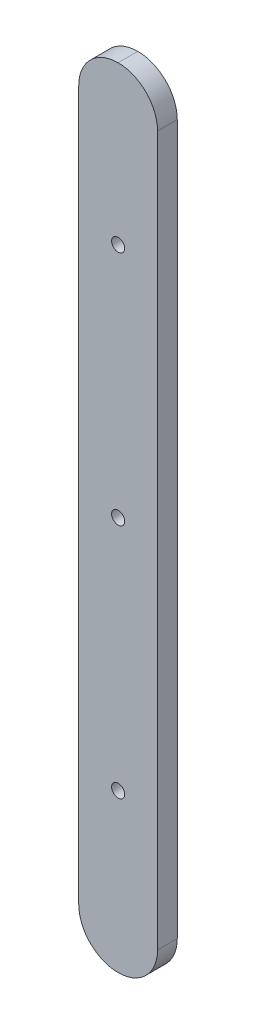
ISO-10303-21;
HEADER;
FILE_DESCRIPTION(('STEP AP214'),'2;1');
FILE_NAME('part.step','',(''),(''),'','','');
FILE_SCHEMA(('AUTOMOTIVE_DESIGN { 1 0 10303 214 1 1 1 1 }'));
ENDSEC;
DATA;
#1=APPLICATION_CONTEXT('core data for automotive mechanical design processes');
#2=APPLICATION_PROTOCOL_DEFINITION('international standard','automotive_design',2000,#1);
#3=PRODUCT_CONTEXT('',#1,'mechanical');
#4=PRODUCT('Part','Part','',(#3));
#5=PRODUCT_RELATED_PRODUCT_CATEGORY('part','',(#4));
#6=PRODUCT_DEFINITION_FORMATION('','',#4);
#7=PRODUCT_DEFINITION_CONTEXT('part definition',#1,'design');
#8=PRODUCT_DEFINITION('design','',#6,#7);
#9=PRODUCT_DEFINITION_SHAPE('','',#8);
#10=(LENGTH_UNIT() NAMED_UNIT(*) SI_UNIT(.MILLI.,.METRE.));
#11=(NAMED_UNIT(*) PLANE_ANGLE_UNIT() SI_UNIT($,.RADIAN.));
#12=(NAMED_UNIT(*) SI_UNIT($,.STERADIAN.) SOLID_ANGLE_UNIT());
#13=UNCERTAINTY_MEASURE_WITH_UNIT(LENGTH_MEASURE(1.E-05),#10,'distance_accuracy_value','');
#14=(GEOMETRIC_REPRESENTATION_CONTEXT(3) GLOBAL_UNCERTAINTY_ASSIGNED_CONTEXT((#13)) GLOBAL_UNIT_ASSIGNED_CONTEXT((#10,
#11,#12)) REPRESENTATION_CONTEXT('',''));
#15=CARTESIAN_POINT('',(0.,0.,0.));
#16=DIRECTION('',(0.,0.,1.));
#17=DIRECTION('',(1.,0.,0.));
#18=AXIS2_PLACEMENT_3D('',#15,#16,#17);
#19=CARTESIAN_POINT('',(0.,200.,5.));
#20=DIRECTION('',(0.,0.,-1.));
#21=DIRECTION('',(-1.,0.,0.));
#22=AXIS2_PLACEMENT_3D('',#19,#20,#21);
#23=PLANE('',#22);
#24=CARTESIAN_POINT('',(10.0000000000006,100.,5.));
#25=DIRECTION('',(0.,0.,1.));
#26=DIRECTION('',(1.,0.,0.));
#27=AXIS2_PLACEMENT_3D('',#24,#25,#26);
#28=CIRCLE('',#27,1.65000000000001);
#29=CARTESIAN_POINT('',(11.6500000000006,100.,5.));
#30=VERTEX_POINT('',#29);
#31=EDGE_CURVE('E147',#30,#30,#28,.T.);
#32=ORIENTED_EDGE('',*,*,#31,.F.);
#33=EDGE_LOOP('',(#32));
#34=FACE_BOUND('',#33,.T.);
#35=DIRECTION('',(0.,-1.,0.));
#36=VECTOR('',#35,1.);
#37=CARTESIAN_POINT('',(0.,0.,5.));
#38=LINE('',#37,#36);
#39=CARTESIAN_POINT('',(0.,190.,5.));
#40=VERTEX_POINT('',#39);
#41=CARTESIAN_POINT('',(0.,10.,5.));
#42=VERTEX_POINT('',#41);
#43=EDGE_CURVE('E92',#40,#42,#38,.T.);
#44=ORIENTED_EDGE('',*,*,#43,.T.);
#45=CARTESIAN_POINT('',(10.,10.,5.));
#46=DIRECTION('',(0.,0.,-1.));
#47=DIRECTION('',(-1.,0.,0.));
#48=AXIS2_PLACEMENT_3D('',#45,#46,#47);
#49=CIRCLE('',#48,10.);
#50=CARTESIAN_POINT('',(10.,0.,5.));
#51=VERTEX_POINT('',#50);
#52=EDGE_CURVE('E124',#42,#51,#49,.F.);
#53=ORIENTED_EDGE('',*,*,#52,.T.);
#54=CARTESIAN_POINT('',(10.,10.,5.));
#55=DIRECTION('',(0.,0.,-1.));
#56=DIRECTION('',(-1.,0.,0.));
#57=AXIS2_PLACEMENT_3D('',#54,#55,#56);
#58=CIRCLE('',#57,10.);
#59=CARTESIAN_POINT('',(20.,10.,5.));
#60=VERTEX_POINT('',#59);
#61=EDGE_CURVE('E122',#51,#60,#58,.F.);
#62=ORIENTED_EDGE('',*,*,#61,.T.);
#63=DIRECTION('',(0.,1.,0.));
#64=VECTOR('',#63,1.);
#65=CARTESIAN_POINT('',(20.,0.,5.));
#66=LINE('',#65,#64);
#67=CARTESIAN_POINT('',(20.,190.,5.));
#68=VERTEX_POINT('',#67);
#69=EDGE_CURVE('E109',#60,#68,#66,.T.);
#70=ORIENTED_EDGE('',*,*,#69,.T.);
#71=CARTESIAN_POINT('',(10.,190.,5.));
#72=DIRECTION('',(0.,0.,-1.));
#73=DIRECTION('',(-1.,0.,0.));
#74=AXIS2_PLACEMENT_3D('',#71,#72,#73);
#75=CIRCLE('',#74,10.);
#76=CARTESIAN_POINT('',(10.,200.,5.));
#77=VERTEX_POINT('',#76);
#78=EDGE_CURVE('E47',#68,#77,#75,.F.);
#79=ORIENTED_EDGE('',*,*,#78,.T.);
#80=CARTESIAN_POINT('',(10.,190.,5.));
#81=DIRECTION('',(0.,0.,-1.));
#82=DIRECTION('',(-1.,0.,0.));
#83=AXIS2_PLACEMENT_3D('',#80,#81,#82);
#84=CIRCLE('',#83,10.);
#85=EDGE_CURVE('E119',#77,#40,#84,.F.);
#86=ORIENTED_EDGE('',*,*,#85,.T.);
#87=EDGE_LOOP('',(#44,#53,#62,#70,#79,#86));
#88=FACE_BOUND('',#87,.T.);
#89=CARTESIAN_POINT('',(9.99999999999998,160.,5.));
#90=DIRECTION('',(0.,0.,1.));
#91=DIRECTION('',(1.,0.,0.));
#92=AXIS2_PLACEMENT_3D('',#89,#90,#91);
#93=CIRCLE('',#92,1.65000000000001);
#94=CARTESIAN_POINT('',(11.65,160.,5.));
#95=VERTEX_POINT('',#94);
#96=EDGE_CURVE('E105',#95,#95,#93,.T.);
#97=ORIENTED_EDGE('',*,*,#96,.F.);
#98=EDGE_LOOP('',(#97));
#99=FACE_BOUND('',#98,.T.);
#100=CARTESIAN_POINT('',(10.0000000000012,40.,5.));
#101=DIRECTION('',(0.,0.,1.));
#102=DIRECTION('',(1.,0.,0.));
#103=AXIS2_PLACEMENT_3D('',#100,#101,#102);
#104=CIRCLE('',#103,1.65000000000001);
#105=CARTESIAN_POINT('',(11.6500000000012,40.,5.));
#106=VERTEX_POINT('',#105);
#107=EDGE_CURVE('E132',#106,#106,#104,.T.);
#108=ORIENTED_EDGE('',*,*,#107,.F.);
#109=EDGE_LOOP('',(#108));
#110=FACE_BOUND('',#109,.T.);
#111=ADVANCED_FACE('F30',(#34,#88,#99,#110),#23,.F.);
#112=CARTESIAN_POINT('',(0.,200.,0.));
#113=DIRECTION('',(0.,0.,-1.));
#114=DIRECTION('',(-1.,0.,0.));
#115=AXIS2_PLACEMENT_3D('',#112,#113,#114);
#116=PLANE('',#115);
#117=CARTESIAN_POINT('',(10.0000000000006,100.,0.));
#118=DIRECTION('',(0.,0.,1.));
#119=DIRECTION('',(1.,0.,0.));
#120=AXIS2_PLACEMENT_3D('',#117,#118,#119);
#121=CIRCLE('',#120,1.65000000000001);
#122=CARTESIAN_POINT('',(11.6500000000006,100.,0.));
#123=VERTEX_POINT('',#122);
#124=EDGE_CURVE('E150',#123,#123,#121,.T.);
#125=ORIENTED_EDGE('',*,*,#124,.T.);
#126=EDGE_LOOP('',(#125));
#127=FACE_BOUND('',#126,.T.);
#128=CARTESIAN_POINT('',(10.,10.,0.));
#129=DIRECTION('',(0.,0.,-1.));
#130=DIRECTION('',(-1.,0.,0.));
#131=AXIS2_PLACEMENT_3D('',#128,#129,#130);
#132=CIRCLE('',#131,10.);
#133=CARTESIAN_POINT('',(20.,10.,0.));
#134=VERTEX_POINT('',#133);
#135=CARTESIAN_POINT('',(10.,0.,0.));
#136=VERTEX_POINT('',#135);
#137=EDGE_CURVE('E111',#134,#136,#132,.T.);
#138=ORIENTED_EDGE('',*,*,#137,.T.);
#139=CARTESIAN_POINT('',(10.,10.,0.));
#140=DIRECTION('',(0.,0.,-1.));
#141=DIRECTION('',(-1.,0.,0.));
#142=AXIS2_PLACEMENT_3D('',#139,#140,#141);
#143=CIRCLE('',#142,10.);
#144=CARTESIAN_POINT('',(0.,10.,0.));
#145=VERTEX_POINT('',#144);
#146=EDGE_CURVE('E96',#136,#145,#143,.T.);
#147=ORIENTED_EDGE('',*,*,#146,.T.);
#148=DIRECTION('',(0.,-1.,0.));
#149=VECTOR('',#148,1.);
#150=CARTESIAN_POINT('',(0.,0.,0.));
#151=LINE('',#150,#149);
#152=CARTESIAN_POINT('',(0.,190.,0.));
#153=VERTEX_POINT('',#152);
#154=EDGE_CURVE('E89',#153,#145,#151,.T.);
#155=ORIENTED_EDGE('',*,*,#154,.F.);
#156=CARTESIAN_POINT('',(10.,190.,0.));
#157=DIRECTION('',(0.,0.,-1.));
#158=DIRECTION('',(-1.,0.,0.));
#159=AXIS2_PLACEMENT_3D('',#156,#157,#158);
#160=CIRCLE('',#159,10.);
#161=CARTESIAN_POINT('',(10.,200.,0.));
#162=VERTEX_POINT('',#161);
#163=EDGE_CURVE('E101',#153,#162,#160,.T.);
#164=ORIENTED_EDGE('',*,*,#163,.T.);
#165=CARTESIAN_POINT('',(10.,190.,0.));
#166=DIRECTION('',(0.,0.,-1.));
#167=DIRECTION('',(-1.,0.,0.));
#168=AXIS2_PLACEMENT_3D('',#165,#166,#167);
#169=CIRCLE('',#168,10.);
#170=CARTESIAN_POINT('',(20.,190.,0.));
#171=VERTEX_POINT('',#170);
#172=EDGE_CURVE('E108',#162,#171,#169,.T.);
#173=ORIENTED_EDGE('',*,*,#172,.T.);
#174=DIRECTION('',(0.,1.,0.));
#175=VECTOR('',#174,1.);
#176=CARTESIAN_POINT('',(20.,0.,0.));
#177=LINE('',#176,#175);
#178=EDGE_CURVE('E104',#134,#171,#177,.T.);
#179=ORIENTED_EDGE('',*,*,#178,.F.);
#180=EDGE_LOOP('',(#138,#147,#155,#164,#173,#179));
#181=FACE_BOUND('',#180,.T.);
#182=CARTESIAN_POINT('',(9.99999999999998,160.,0.));
#183=DIRECTION('',(0.,0.,1.));
#184=DIRECTION('',(1.,0.,0.));
#185=AXIS2_PLACEMENT_3D('',#182,#183,#184);
#186=CIRCLE('',#185,1.65000000000001);
#187=CARTESIAN_POINT('',(11.65,160.,0.));
#188=VERTEX_POINT('',#187);
#189=EDGE_CURVE('E144',#188,#188,#186,.T.);
#190=ORIENTED_EDGE('',*,*,#189,.T.);
#191=EDGE_LOOP('',(#190));
#192=FACE_BOUND('',#191,.T.);
#193=CARTESIAN_POINT('',(10.0000000000012,40.,0.));
#194=DIRECTION('',(0.,0.,1.));
#195=DIRECTION('',(1.,0.,0.));
#196=AXIS2_PLACEMENT_3D('',#193,#194,#195);
#197=CIRCLE('',#196,1.65000000000001);
#198=CARTESIAN_POINT('',(11.6500000000012,40.,0.));
#199=VERTEX_POINT('',#198);
#200=EDGE_CURVE('E128',#199,#199,#197,.T.);
#201=ORIENTED_EDGE('',*,*,#200,.T.);
#202=EDGE_LOOP('',(#201));
#203=FACE_BOUND('',#202,.T.);
#204=ADVANCED_FACE('F99',(#127,#181,#192,#203),#116,.T.);
#205=CARTESIAN_POINT('',(0.,0.,5.));
#206=DIRECTION('',(1.,0.,0.));
#207=DIRECTION('',(0.,0.,-1.));
#208=AXIS2_PLACEMENT_3D('',#205,#206,#207);
#209=PLANE('',#208);
#210=ORIENTED_EDGE('',*,*,#154,.T.);
#211=DIRECTION('',(0.,0.,-1.));
#212=VECTOR('',#211,1.);
#213=CARTESIAN_POINT('',(0.,10.,5.));
#214=LINE('',#213,#212);
#215=EDGE_CURVE('E95',#145,#42,#214,.F.);
#216=ORIENTED_EDGE('',*,*,#215,.T.);
#217=ORIENTED_EDGE('',*,*,#43,.F.);
#218=DIRECTION('',(0.,0.,-1.));
#219=VECTOR('',#218,1.);
#220=CARTESIAN_POINT('',(0.,190.,5.));
#221=LINE('',#220,#219);
#222=EDGE_CURVE('E85',#40,#153,#221,.T.);
#223=ORIENTED_EDGE('',*,*,#222,.T.);
#224=EDGE_LOOP('',(#210,#216,#217,#223));
#225=FACE_BOUND('',#224,.T.);
#226=ADVANCED_FACE('F87',(#225),#209,.F.);
#227=CARTESIAN_POINT('',(20.,0.,5.));
#228=DIRECTION('',(-1.,0.,0.));
#229=DIRECTION('',(0.,0.,1.));
#230=AXIS2_PLACEMENT_3D('',#227,#228,#229);
#231=PLANE('',#230);
#232=ORIENTED_EDGE('',*,*,#69,.F.);
#233=DIRECTION('',(0.,0.,-1.));
#234=VECTOR('',#233,1.);
#235=CARTESIAN_POINT('',(20.,10.,5.));
#236=LINE('',#235,#234);
#237=EDGE_CURVE('E11',#60,#134,#236,.T.);
#238=ORIENTED_EDGE('',*,*,#237,.T.);
#239=ORIENTED_EDGE('',*,*,#178,.T.);
#240=DIRECTION('',(0.,0.,-1.));
#241=VECTOR('',#240,1.);
#242=CARTESIAN_POINT('',(20.,190.,5.));
#243=LINE('',#242,#241);
#244=EDGE_CURVE('E39',#171,#68,#243,.F.);
#245=ORIENTED_EDGE('',*,*,#244,.T.);
#246=EDGE_LOOP('',(#232,#238,#239,#245));
#247=FACE_BOUND('',#246,.T.);
#248=ADVANCED_FACE('F140',(#247),#231,.F.);
#249=CARTESIAN_POINT('',(9.99999999999998,160.,5.));
#250=DIRECTION('',(0.,0.,-1.));
#251=DIRECTION('',(-1.,0.,0.));
#252=AXIS2_PLACEMENT_3D('',#249,#250,#251);
#253=CYLINDRICAL_SURFACE('',#252,1.65000000000001);
#254=ORIENTED_EDGE('',*,*,#96,.T.);
#255=EDGE_LOOP('',(#254));
#256=FACE_BOUND('',#255,.T.);
#257=ORIENTED_EDGE('',*,*,#189,.F.);
#258=EDGE_LOOP('',(#257));
#259=FACE_BOUND('',#258,.T.);
#260=ADVANCED_FACE('F171',(#256,#259),#253,.F.);
#261=CARTESIAN_POINT('',(10.0000000000006,100.,5.));
#262=DIRECTION('',(0.,0.,-1.));
#263=DIRECTION('',(-1.,0.,0.));
#264=AXIS2_PLACEMENT_3D('',#261,#262,#263);
#265=CYLINDRICAL_SURFACE('',#264,1.65000000000001);
#266=ORIENTED_EDGE('',*,*,#31,.T.);
#267=EDGE_LOOP('',(#266));
#268=FACE_BOUND('',#267,.T.);
#269=ORIENTED_EDGE('',*,*,#124,.F.);
#270=EDGE_LOOP('',(#269));
#271=FACE_BOUND('',#270,.T.);
#272=ADVANCED_FACE('F205',(#268,#271),#265,.F.);
#273=CARTESIAN_POINT('',(10.0000000000012,40.,5.));
#274=DIRECTION('',(0.,0.,-1.));
#275=DIRECTION('',(-1.,0.,0.));
#276=AXIS2_PLACEMENT_3D('',#273,#274,#275);
#277=CYLINDRICAL_SURFACE('',#276,1.65000000000001);
#278=ORIENTED_EDGE('',*,*,#107,.T.);
#279=EDGE_LOOP('',(#278));
#280=FACE_BOUND('',#279,.T.);
#281=ORIENTED_EDGE('',*,*,#200,.F.);
#282=EDGE_LOOP('',(#281));
#283=FACE_BOUND('',#282,.T.);
#284=ADVANCED_FACE('F158',(#280,#283),#277,.F.);
#285=CARTESIAN_POINT('',(10.,10.,5.));
#286=DIRECTION('',(0.,0.,-1.));
#287=DIRECTION('',(-1.,0.,0.));
#288=AXIS2_PLACEMENT_3D('',#285,#286,#287);
#289=CYLINDRICAL_SURFACE('',#288,10.);
#290=ORIENTED_EDGE('',*,*,#237,.F.);
#291=ORIENTED_EDGE('',*,*,#61,.F.);
#292=DIRECTION('',(0.,0.,-1.));
#293=VECTOR('',#292,1.);
#294=CARTESIAN_POINT('',(10.,0.,5.));
#295=LINE('',#294,#293);
#296=EDGE_CURVE('E126',#136,#51,#295,.F.);
#297=ORIENTED_EDGE('',*,*,#296,.F.);
#298=ORIENTED_EDGE('',*,*,#137,.F.);
#299=EDGE_LOOP('',(#290,#291,#297,#298));
#300=FACE_BOUND('',#299,.T.);
#301=ADVANCED_FACE('F181',(#300),#289,.T.);
#302=CARTESIAN_POINT('',(10.,10.,5.));
#303=DIRECTION('',(0.,0.,-1.));
#304=DIRECTION('',(-1.,0.,0.));
#305=AXIS2_PLACEMENT_3D('',#302,#303,#304);
#306=CYLINDRICAL_SURFACE('',#305,10.);
#307=ORIENTED_EDGE('',*,*,#52,.F.);
#308=ORIENTED_EDGE('',*,*,#215,.F.);
#309=ORIENTED_EDGE('',*,*,#146,.F.);
#310=ORIENTED_EDGE('',*,*,#296,.T.);
#311=EDGE_LOOP('',(#307,#308,#309,#310));
#312=FACE_BOUND('',#311,.T.);
#313=ADVANCED_FACE('F178',(#312),#306,.T.);
#314=CARTESIAN_POINT('',(10.,190.,5.));
#315=DIRECTION('',(0.,0.,-1.));
#316=DIRECTION('',(-1.,0.,0.));
#317=AXIS2_PLACEMENT_3D('',#314,#315,#316);
#318=CYLINDRICAL_SURFACE('',#317,10.);
#319=ORIENTED_EDGE('',*,*,#222,.F.);
#320=ORIENTED_EDGE('',*,*,#85,.F.);
#321=DIRECTION('',(0.,0.,-1.));
#322=VECTOR('',#321,1.);
#323=CARTESIAN_POINT('',(10.,200.,5.));
#324=LINE('',#323,#322);
#325=EDGE_CURVE('E34',#162,#77,#324,.F.);
#326=ORIENTED_EDGE('',*,*,#325,.F.);
#327=ORIENTED_EDGE('',*,*,#163,.F.);
#328=EDGE_LOOP('',(#319,#320,#326,#327));
#329=FACE_BOUND('',#328,.T.);
#330=ADVANCED_FACE('F32',(#329),#318,.T.);
#331=CARTESIAN_POINT('',(10.,190.,5.));
#332=DIRECTION('',(0.,0.,-1.));
#333=DIRECTION('',(-1.,0.,0.));
#334=AXIS2_PLACEMENT_3D('',#331,#332,#333);
#335=CYLINDRICAL_SURFACE('',#334,10.);
#336=ORIENTED_EDGE('',*,*,#78,.F.);
#337=ORIENTED_EDGE('',*,*,#244,.F.);
#338=ORIENTED_EDGE('',*,*,#172,.F.);
#339=ORIENTED_EDGE('',*,*,#325,.T.);
#340=EDGE_LOOP('',(#336,#337,#338,#339));
#341=FACE_BOUND('',#340,.T.);
#342=ADVANCED_FACE('F134',(#341),#335,.T.);
#343=CLOSED_SHELL('',(#111,#204,#226,#248,#260,#272,#284,#301,#313,#330,#342));
#344=MANIFOLD_SOLID_BREP('B2',#343);
#345=ADVANCED_BREP_SHAPE_REPRESENTATION('',(#18,#344),#14);
#346=SHAPE_DEFINITION_REPRESENTATION(#9,#345);
ENDSEC;
END-ISO-10303-21;
